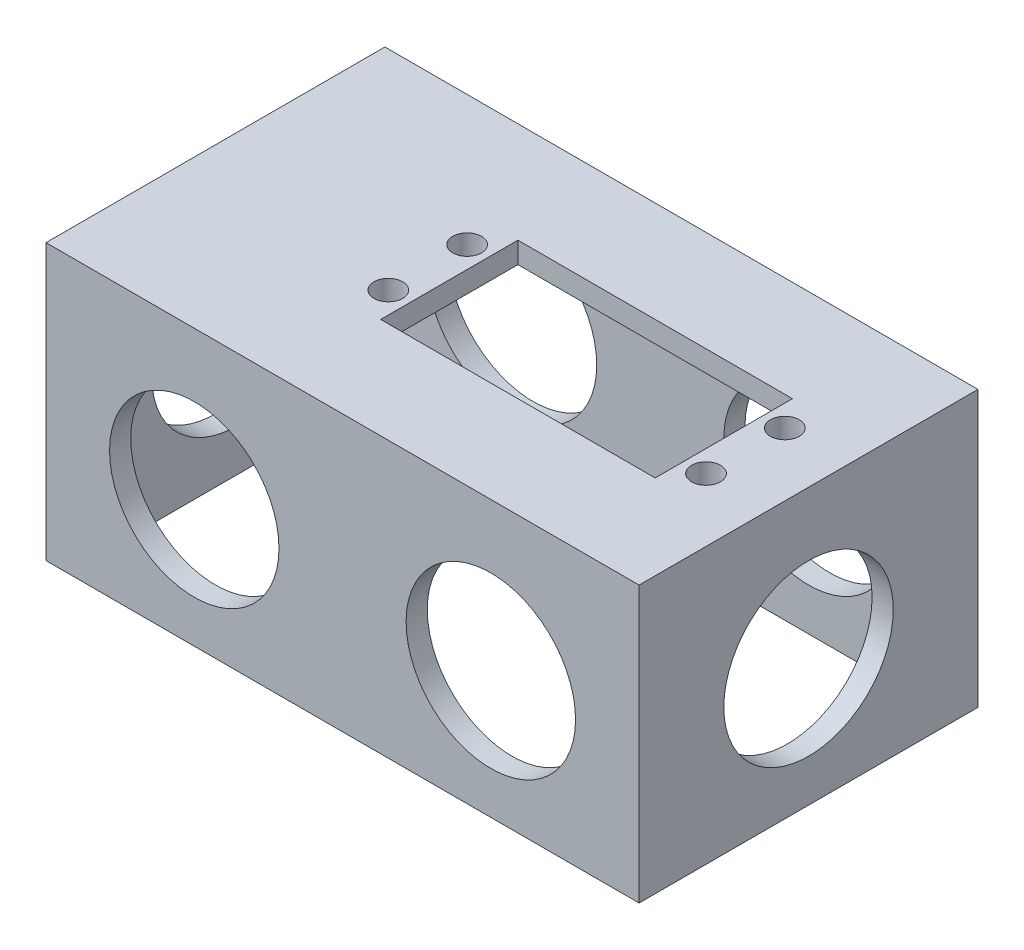
ISO-10303-21;
HEADER;
FILE_DESCRIPTION(('STEP AP214'),'2;1');
FILE_NAME('part.step','',(''),(''),'','','');
FILE_SCHEMA(('AUTOMOTIVE_DESIGN { 1 0 10303 214 1 1 1 1 }'));
ENDSEC;
DATA;
#1=APPLICATION_CONTEXT('core data for automotive mechanical design processes');
#2=APPLICATION_PROTOCOL_DEFINITION('international standard','automotive_design',2000,#1);
#3=PRODUCT_CONTEXT('',#1,'mechanical');
#4=PRODUCT('Part','Part','',(#3));
#5=PRODUCT_RELATED_PRODUCT_CATEGORY('part','',(#4));
#6=PRODUCT_DEFINITION_FORMATION('','',#4);
#7=PRODUCT_DEFINITION_CONTEXT('part definition',#1,'design');
#8=PRODUCT_DEFINITION('design','',#6,#7);
#9=PRODUCT_DEFINITION_SHAPE('','',#8);
#10=(LENGTH_UNIT() NAMED_UNIT(*) SI_UNIT(.MILLI.,.METRE.));
#11=(NAMED_UNIT(*) PLANE_ANGLE_UNIT() SI_UNIT($,.RADIAN.));
#12=(NAMED_UNIT(*) SI_UNIT($,.STERADIAN.) SOLID_ANGLE_UNIT());
#13=UNCERTAINTY_MEASURE_WITH_UNIT(LENGTH_MEASURE(1.E-05),#10,'distance_accuracy_value','');
#14=(GEOMETRIC_REPRESENTATION_CONTEXT(3) GLOBAL_UNCERTAINTY_ASSIGNED_CONTEXT((#13)) GLOBAL_UNIT_ASSIGNED_CONTEXT((#10,
#11,#12)) REPRESENTATION_CONTEXT('',''));
#15=CARTESIAN_POINT('',(0.,0.,0.));
#16=DIRECTION('',(0.,0.,1.));
#17=DIRECTION('',(1.,0.,0.));
#18=AXIS2_PLACEMENT_3D('',#15,#16,#17);
#19=CARTESIAN_POINT('',(0.,38.1,0.));
#20=DIRECTION('',(0.,-1.,0.));
#21=DIRECTION('',(0.,0.,-1.));
#22=AXIS2_PLACEMENT_3D('',#19,#20,#21);
#23=PLANE('',#22);
#24=CARTESIAN_POINT('',(79.4385,38.1,-31.3055));
#25=DIRECTION('',(0.,-1.,0.));
#26=DIRECTION('',(0.,0.,-1.));
#27=AXIS2_PLACEMENT_3D('',#24,#25,#26);
#28=CIRCLE('',#27,2.15900000000001);
#29=CARTESIAN_POINT('',(79.4385,38.1,-33.4645));
#30=VERTEX_POINT('',#29);
#31=EDGE_CURVE('E387',#30,#30,#28,.F.);
#32=ORIENTED_EDGE('',*,*,#31,.T.);
#33=EDGE_LOOP('',(#32));
#34=FACE_BOUND('',#33,.T.);
#35=CARTESIAN_POINT('',(79.4385,38.1,-19.4945));
#36=DIRECTION('',(0.,-1.,0.));
#37=DIRECTION('',(0.,0.,-1.));
#38=AXIS2_PLACEMENT_3D('',#35,#36,#37);
#39=CIRCLE('',#38,2.15900000000001);
#40=CARTESIAN_POINT('',(79.4385,38.1,-21.6535));
#41=VERTEX_POINT('',#40);
#42=EDGE_CURVE('E390',#41,#41,#39,.F.);
#43=ORIENTED_EDGE('',*,*,#42,.T.);
#44=EDGE_LOOP('',(#43));
#45=FACE_BOUND('',#44,.T.);
#46=CARTESIAN_POINT('',(31.8135,38.1,-19.4945));
#47=DIRECTION('',(0.,-1.,0.));
#48=DIRECTION('',(0.,0.,-1.));
#49=AXIS2_PLACEMENT_3D('',#46,#47,#48);
#50=CIRCLE('',#49,2.15899999999999);
#51=CARTESIAN_POINT('',(31.8135,38.1,-21.6535));
#52=VERTEX_POINT('',#51);
#53=EDGE_CURVE('E394',#52,#52,#50,.F.);
#54=ORIENTED_EDGE('',*,*,#53,.T.);
#55=EDGE_LOOP('',(#54));
#56=FACE_BOUND('',#55,.T.);
#57=CARTESIAN_POINT('',(31.8135,38.1,-31.3055));
#58=DIRECTION('',(0.,-1.,0.));
#59=DIRECTION('',(0.,0.,-1.));
#60=AXIS2_PLACEMENT_3D('',#57,#58,#59);
#61=CIRCLE('',#60,2.15899999999999);
#62=CARTESIAN_POINT('',(31.8135,38.1,-33.4645));
#63=VERTEX_POINT('',#62);
#64=EDGE_CURVE('E384',#63,#63,#61,.F.);
#65=ORIENTED_EDGE('',*,*,#64,.T.);
#66=EDGE_LOOP('',(#65));
#67=FACE_BOUND('',#66,.T.);
#68=DIRECTION('',(0.,0.,1.));
#69=VECTOR('',#68,1.);
#70=CARTESIAN_POINT('',(3.175,38.1,-3.175));
#71=LINE('',#70,#69);
#72=CARTESIAN_POINT('',(3.175,38.1,-47.625));
#73=VERTEX_POINT('',#72);
#74=CARTESIAN_POINT('',(3.175,38.1,-3.175));
#75=VERTEX_POINT('',#74);
#76=EDGE_CURVE('E199',#73,#75,#71,.T.);
#77=ORIENTED_EDGE('',*,*,#76,.F.);
#78=DIRECTION('',(-1.,0.,0.));
#79=VECTOR('',#78,1.);
#80=CARTESIAN_POINT('',(3.175,38.1,-47.625));
#81=LINE('',#80,#79);
#82=CARTESIAN_POINT('',(85.725,38.1,-47.625));
#83=VERTEX_POINT('',#82);
#84=EDGE_CURVE('E209',#83,#73,#81,.T.);
#85=ORIENTED_EDGE('',*,*,#84,.F.);
#86=DIRECTION('',(0.,0.,-1.));
#87=VECTOR('',#86,1.);
#88=CARTESIAN_POINT('',(85.725,38.1,-3.175));
#89=LINE('',#88,#87);
#90=CARTESIAN_POINT('',(85.725,38.1,-3.175));
#91=VERTEX_POINT('',#90);
#92=EDGE_CURVE('E206',#91,#83,#89,.T.);
#93=ORIENTED_EDGE('',*,*,#92,.F.);
#94=DIRECTION('',(1.,0.,0.));
#95=VECTOR('',#94,1.);
#96=CARTESIAN_POINT('',(3.175,38.1,-3.175));
#97=LINE('',#96,#95);
#98=EDGE_CURVE('E202',#75,#91,#97,.T.);
#99=ORIENTED_EDGE('',*,*,#98,.F.);
#100=EDGE_LOOP('',(#77,#85,#93,#99));
#101=FACE_BOUND('',#100,.T.);
#102=DIRECTION('',(1.,0.,0.));
#103=VECTOR('',#102,1.);
#104=CARTESIAN_POINT('',(76.2,38.1,-15.113));
#105=LINE('',#104,#103);
#106=CARTESIAN_POINT('',(35.052,38.1,-15.113));
#107=VERTEX_POINT('',#106);
#108=CARTESIAN_POINT('',(76.2,38.1,-15.113));
#109=VERTEX_POINT('',#108);
#110=EDGE_CURVE('E140',#107,#109,#105,.T.);
#111=ORIENTED_EDGE('',*,*,#110,.T.);
#112=DIRECTION('',(0.,0.,-1.));
#113=VECTOR('',#112,1.);
#114=CARTESIAN_POINT('',(76.2,38.1,-15.113));
#115=LINE('',#114,#113);
#116=CARTESIAN_POINT('',(76.2,38.1,-35.687));
#117=VERTEX_POINT('',#116);
#118=EDGE_CURVE('E135',#109,#117,#115,.T.);
#119=ORIENTED_EDGE('',*,*,#118,.T.);
#120=DIRECTION('',(-1.,0.,0.));
#121=VECTOR('',#120,1.);
#122=CARTESIAN_POINT('',(76.2,38.1,-35.687));
#123=LINE('',#122,#121);
#124=CARTESIAN_POINT('',(35.052,38.1,-35.687));
#125=VERTEX_POINT('',#124);
#126=EDGE_CURVE('E124',#117,#125,#123,.T.);
#127=ORIENTED_EDGE('',*,*,#126,.T.);
#128=DIRECTION('',(0.,0.,1.));
#129=VECTOR('',#128,1.);
#130=CARTESIAN_POINT('',(35.052,38.1,-15.113));
#131=LINE('',#130,#129);
#132=EDGE_CURVE('E144',#125,#107,#131,.T.);
#133=ORIENTED_EDGE('',*,*,#132,.T.);
#134=EDGE_LOOP('',(#111,#119,#127,#133));
#135=FACE_BOUND('',#134,.T.);
#136=ADVANCED_FACE('F34',(#34,#45,#56,#67,#101,#135),#23,.T.);
#137=CARTESIAN_POINT('',(0.,0.,0.));
#138=DIRECTION('',(0.,-1.,0.));
#139=DIRECTION('',(0.,0.,-1.));
#140=AXIS2_PLACEMENT_3D('',#137,#138,#139);
#141=PLANE('',#140);
#142=DIRECTION('',(0.,0.,1.));
#143=VECTOR('',#142,1.);
#144=CARTESIAN_POINT('',(0.,0.,0.));
#145=LINE('',#144,#143);
#146=CARTESIAN_POINT('',(0.,0.,-50.8));
#147=VERTEX_POINT('',#146);
#148=CARTESIAN_POINT('',(0.,0.,0.));
#149=VERTEX_POINT('',#148);
#150=EDGE_CURVE('E232',#147,#149,#145,.T.);
#151=ORIENTED_EDGE('',*,*,#150,.F.);
#152=DIRECTION('',(-1.,0.,0.));
#153=VECTOR('',#152,1.);
#154=CARTESIAN_POINT('',(0.,0.,-50.8));
#155=LINE('',#154,#153);
#156=CARTESIAN_POINT('',(88.9,0.,-50.8));
#157=VERTEX_POINT('',#156);
#158=EDGE_CURVE('E239',#157,#147,#155,.T.);
#159=ORIENTED_EDGE('',*,*,#158,.F.);
#160=DIRECTION('',(0.,0.,-1.));
#161=VECTOR('',#160,1.);
#162=CARTESIAN_POINT('',(88.9,0.,0.));
#163=LINE('',#162,#161);
#164=CARTESIAN_POINT('',(88.9,0.,0.));
#165=VERTEX_POINT('',#164);
#166=EDGE_CURVE('E237',#165,#157,#163,.T.);
#167=ORIENTED_EDGE('',*,*,#166,.F.);
#168=DIRECTION('',(1.,0.,0.));
#169=VECTOR('',#168,1.);
#170=CARTESIAN_POINT('',(0.,0.,0.));
#171=LINE('',#170,#169);
#172=EDGE_CURVE('E235',#149,#165,#171,.T.);
#173=ORIENTED_EDGE('',*,*,#172,.F.);
#174=EDGE_LOOP('',(#151,#159,#167,#173));
#175=FACE_BOUND('',#174,.T.);
#176=DIRECTION('',(-1.,0.,0.));
#177=VECTOR('',#176,1.);
#178=CARTESIAN_POINT('',(3.175,0.,-47.625));
#179=LINE('',#178,#177);
#180=CARTESIAN_POINT('',(85.725,0.,-47.625));
#181=VERTEX_POINT('',#180);
#182=CARTESIAN_POINT('',(3.175,0.,-47.625));
#183=VERTEX_POINT('',#182);
#184=EDGE_CURVE('E203',#181,#183,#179,.T.);
#185=ORIENTED_EDGE('',*,*,#184,.T.);
#186=DIRECTION('',(0.,0.,1.));
#187=VECTOR('',#186,1.);
#188=CARTESIAN_POINT('',(3.175,0.,-3.175));
#189=LINE('',#188,#187);
#190=CARTESIAN_POINT('',(3.175,0.,-3.175));
#191=VERTEX_POINT('',#190);
#192=EDGE_CURVE('E198',#183,#191,#189,.T.);
#193=ORIENTED_EDGE('',*,*,#192,.T.);
#194=DIRECTION('',(1.,0.,0.));
#195=VECTOR('',#194,1.);
#196=CARTESIAN_POINT('',(3.175,0.,-3.175));
#197=LINE('',#196,#195);
#198=CARTESIAN_POINT('',(85.725,0.,-3.175));
#199=VERTEX_POINT('',#198);
#200=EDGE_CURVE('E215',#191,#199,#197,.T.);
#201=ORIENTED_EDGE('',*,*,#200,.T.);
#202=DIRECTION('',(0.,0.,-1.));
#203=VECTOR('',#202,1.);
#204=CARTESIAN_POINT('',(85.725,0.,-3.175));
#205=LINE('',#204,#203);
#206=EDGE_CURVE('E218',#199,#181,#205,.T.);
#207=ORIENTED_EDGE('',*,*,#206,.T.);
#208=EDGE_LOOP('',(#185,#193,#201,#207));
#209=FACE_BOUND('',#208,.T.);
#210=ADVANCED_FACE('F268',(#175,#209),#141,.T.);
#211=CARTESIAN_POINT('',(0.,38.1,0.));
#212=DIRECTION('',(1.,0.,0.));
#213=DIRECTION('',(0.,0.,-1.));
#214=AXIS2_PLACEMENT_3D('',#211,#212,#213);
#215=PLANE('',#214);
#216=CARTESIAN_POINT('',(0.,19.05,-25.4));
#217=DIRECTION('',(1.,0.,0.));
#218=DIRECTION('',(0.,0.,-1.));
#219=AXIS2_PLACEMENT_3D('',#216,#217,#218);
#220=CIRCLE('',#219,12.7);
#221=CARTESIAN_POINT('',(0.,19.05,-38.1));
#222=VERTEX_POINT('',#221);
#223=EDGE_CURVE('E191',#222,#222,#220,.F.);
#224=ORIENTED_EDGE('',*,*,#223,.F.);
#225=EDGE_LOOP('',(#224));
#226=FACE_BOUND('',#225,.T.);
#227=ORIENTED_EDGE('',*,*,#150,.T.);
#228=DIRECTION('',(0.,-1.,0.));
#229=VECTOR('',#228,1.);
#230=CARTESIAN_POINT('',(0.,38.1,0.));
#231=LINE('',#230,#229);
#232=CARTESIAN_POINT('',(0.,41.275,0.));
#233=VERTEX_POINT('',#232);
#234=EDGE_CURVE('E11',#233,#149,#231,.T.);
#235=ORIENTED_EDGE('',*,*,#234,.F.);
#236=DIRECTION('',(0.,0.,1.));
#237=VECTOR('',#236,1.);
#238=CARTESIAN_POINT('',(0.,41.275,-50.8));
#239=LINE('',#238,#237);
#240=CARTESIAN_POINT('',(0.,41.275,-50.8));
#241=VERTEX_POINT('',#240);
#242=EDGE_CURVE('E182',#241,#233,#239,.T.);
#243=ORIENTED_EDGE('',*,*,#242,.F.);
#244=DIRECTION('',(0.,-1.,0.));
#245=VECTOR('',#244,1.);
#246=CARTESIAN_POINT('',(0.,38.1,-50.8));
#247=LINE('',#246,#245);
#248=EDGE_CURVE('E241',#241,#147,#247,.T.);
#249=ORIENTED_EDGE('',*,*,#248,.T.);
#250=EDGE_LOOP('',(#227,#235,#243,#249));
#251=FACE_BOUND('',#250,.T.);
#252=ADVANCED_FACE('F36',(#226,#251),#215,.F.);
#253=CARTESIAN_POINT('',(0.,38.1,0.));
#254=DIRECTION('',(0.,0.,-1.));
#255=DIRECTION('',(-1.,0.,0.));
#256=AXIS2_PLACEMENT_3D('',#253,#254,#255);
#257=PLANE('',#256);
#258=CARTESIAN_POINT('',(66.675,19.05,0.));
#259=DIRECTION('',(0.,0.,-1.));
#260=DIRECTION('',(-1.,0.,0.));
#261=AXIS2_PLACEMENT_3D('',#258,#259,#260);
#262=CIRCLE('',#261,12.7);
#263=CARTESIAN_POINT('',(53.975,19.05,0.));
#264=VERTEX_POINT('',#263);
#265=EDGE_CURVE('E161',#264,#264,#262,.F.);
#266=ORIENTED_EDGE('',*,*,#265,.F.);
#267=EDGE_LOOP('',(#266));
#268=FACE_BOUND('',#267,.T.);
#269=CARTESIAN_POINT('',(22.225,19.05,0.));
#270=DIRECTION('',(0.,0.,-1.));
#271=DIRECTION('',(-1.,0.,0.));
#272=AXIS2_PLACEMENT_3D('',#269,#270,#271);
#273=CIRCLE('',#272,12.7);
#274=CARTESIAN_POINT('',(9.525,19.05,0.));
#275=VERTEX_POINT('',#274);
#276=EDGE_CURVE('E162',#275,#275,#273,.F.);
#277=ORIENTED_EDGE('',*,*,#276,.F.);
#278=EDGE_LOOP('',(#277));
#279=FACE_BOUND('',#278,.T.);
#280=ORIENTED_EDGE('',*,*,#172,.T.);
#281=DIRECTION('',(0.,-1.,0.));
#282=VECTOR('',#281,1.);
#283=CARTESIAN_POINT('',(88.9,38.1,0.));
#284=LINE('',#283,#282);
#285=CARTESIAN_POINT('',(88.9,41.275,0.));
#286=VERTEX_POINT('',#285);
#287=EDGE_CURVE('E43',#286,#165,#284,.T.);
#288=ORIENTED_EDGE('',*,*,#287,.F.);
#289=DIRECTION('',(1.,0.,0.));
#290=VECTOR('',#289,1.);
#291=CARTESIAN_POINT('',(88.9,41.275,0.));
#292=LINE('',#291,#290);
#293=EDGE_CURVE('E185',#233,#286,#292,.T.);
#294=ORIENTED_EDGE('',*,*,#293,.F.);
#295=ORIENTED_EDGE('',*,*,#234,.T.);
#296=EDGE_LOOP('',(#280,#288,#294,#295));
#297=FACE_BOUND('',#296,.T.);
#298=ADVANCED_FACE('F319',(#268,#279,#297),#257,.F.);
#299=CARTESIAN_POINT('',(88.9,38.1,0.));
#300=DIRECTION('',(-1.,0.,0.));
#301=DIRECTION('',(0.,0.,1.));
#302=AXIS2_PLACEMENT_3D('',#299,#300,#301);
#303=PLANE('',#302);
#304=CARTESIAN_POINT('',(88.9,19.05,-25.4));
#305=DIRECTION('',(1.,0.,0.));
#306=DIRECTION('',(0.,0.,-1.));
#307=AXIS2_PLACEMENT_3D('',#304,#305,#306);
#308=CIRCLE('',#307,12.7);
#309=CARTESIAN_POINT('',(88.9,19.05,-38.1));
#310=VERTEX_POINT('',#309);
#311=EDGE_CURVE('E188',#310,#310,#308,.T.);
#312=ORIENTED_EDGE('',*,*,#311,.F.);
#313=EDGE_LOOP('',(#312));
#314=FACE_BOUND('',#313,.T.);
#315=ORIENTED_EDGE('',*,*,#166,.T.);
#316=DIRECTION('',(0.,-1.,0.));
#317=VECTOR('',#316,1.);
#318=CARTESIAN_POINT('',(88.9,38.1,-50.8));
#319=LINE('',#318,#317);
#320=CARTESIAN_POINT('',(88.9,41.275,-50.8));
#321=VERTEX_POINT('',#320);
#322=EDGE_CURVE('E244',#321,#157,#319,.T.);
#323=ORIENTED_EDGE('',*,*,#322,.F.);
#324=DIRECTION('',(0.,0.,-1.));
#325=VECTOR('',#324,1.);
#326=CARTESIAN_POINT('',(88.9,41.275,-50.8));
#327=LINE('',#326,#325);
#328=EDGE_CURVE('E176',#286,#321,#327,.T.);
#329=ORIENTED_EDGE('',*,*,#328,.F.);
#330=ORIENTED_EDGE('',*,*,#287,.T.);
#331=EDGE_LOOP('',(#315,#323,#329,#330));
#332=FACE_BOUND('',#331,.T.);
#333=ADVANCED_FACE('F287',(#314,#332),#303,.F.);
#334=CARTESIAN_POINT('',(0.,38.1,-50.8));
#335=DIRECTION('',(0.,0.,1.));
#336=DIRECTION('',(1.,0.,0.));
#337=AXIS2_PLACEMENT_3D('',#334,#335,#336);
#338=PLANE('',#337);
#339=CARTESIAN_POINT('',(66.675,19.05,-50.8));
#340=DIRECTION('',(0.,0.,-1.));
#341=DIRECTION('',(-1.,0.,0.));
#342=AXIS2_PLACEMENT_3D('',#339,#340,#341);
#343=CIRCLE('',#342,12.7);
#344=CARTESIAN_POINT('',(53.975,19.05,-50.8));
#345=VERTEX_POINT('',#344);
#346=EDGE_CURVE('E158',#345,#345,#343,.T.);
#347=ORIENTED_EDGE('',*,*,#346,.F.);
#348=EDGE_LOOP('',(#347));
#349=FACE_BOUND('',#348,.T.);
#350=CARTESIAN_POINT('',(22.225,19.05,-50.8));
#351=DIRECTION('',(0.,0.,-1.));
#352=DIRECTION('',(-1.,0.,0.));
#353=AXIS2_PLACEMENT_3D('',#350,#351,#352);
#354=CIRCLE('',#353,12.7);
#355=CARTESIAN_POINT('',(9.525,19.05,-50.8));
#356=VERTEX_POINT('',#355);
#357=EDGE_CURVE('E131',#356,#356,#354,.T.);
#358=ORIENTED_EDGE('',*,*,#357,.F.);
#359=EDGE_LOOP('',(#358));
#360=FACE_BOUND('',#359,.T.);
#361=ORIENTED_EDGE('',*,*,#158,.T.);
#362=ORIENTED_EDGE('',*,*,#248,.F.);
#363=DIRECTION('',(-1.,0.,0.));
#364=VECTOR('',#363,1.);
#365=CARTESIAN_POINT('',(88.9,41.275,-50.8));
#366=LINE('',#365,#364);
#367=EDGE_CURVE('E179',#321,#241,#366,.T.);
#368=ORIENTED_EDGE('',*,*,#367,.F.);
#369=ORIENTED_EDGE('',*,*,#322,.T.);
#370=EDGE_LOOP('',(#361,#362,#368,#369));
#371=FACE_BOUND('',#370,.T.);
#372=ADVANCED_FACE('F278',(#349,#360,#371),#338,.F.);
#373=CARTESIAN_POINT('',(3.175,38.1,-3.175));
#374=DIRECTION('',(1.,0.,0.));
#375=DIRECTION('',(0.,0.,-1.));
#376=AXIS2_PLACEMENT_3D('',#373,#374,#375);
#377=PLANE('',#376);
#378=CARTESIAN_POINT('',(3.175,19.05,-25.4));
#379=DIRECTION('',(1.,0.,0.));
#380=DIRECTION('',(0.,0.,-1.));
#381=AXIS2_PLACEMENT_3D('',#378,#379,#380);
#382=CIRCLE('',#381,12.7);
#383=CARTESIAN_POINT('',(3.175,19.05,-38.1));
#384=VERTEX_POINT('',#383);
#385=EDGE_CURVE('E195',#384,#384,#382,.T.);
#386=ORIENTED_EDGE('',*,*,#385,.F.);
#387=EDGE_LOOP('',(#386));
#388=FACE_BOUND('',#387,.T.);
#389=ORIENTED_EDGE('',*,*,#192,.F.);
#390=DIRECTION('',(0.,-1.,0.));
#391=VECTOR('',#390,1.);
#392=CARTESIAN_POINT('',(3.175,38.1,-47.625));
#393=LINE('',#392,#391);
#394=EDGE_CURVE('E212',#73,#183,#393,.T.);
#395=ORIENTED_EDGE('',*,*,#394,.F.);
#396=ORIENTED_EDGE('',*,*,#76,.T.);
#397=DIRECTION('',(0.,-1.,0.));
#398=VECTOR('',#397,1.);
#399=CARTESIAN_POINT('',(3.175,38.1,-3.175));
#400=LINE('',#399,#398);
#401=EDGE_CURVE('E229',#75,#191,#400,.T.);
#402=ORIENTED_EDGE('',*,*,#401,.T.);
#403=EDGE_LOOP('',(#389,#395,#396,#402));
#404=FACE_BOUND('',#403,.T.);
#405=ADVANCED_FACE('F276',(#388,#404),#377,.T.);
#406=CARTESIAN_POINT('',(3.175,38.1,-3.175));
#407=DIRECTION('',(0.,0.,-1.));
#408=DIRECTION('',(-1.,0.,0.));
#409=AXIS2_PLACEMENT_3D('',#406,#407,#408);
#410=PLANE('',#409);
#411=CARTESIAN_POINT('',(66.675,19.05,-3.17499999999999));
#412=DIRECTION('',(0.,0.,-1.));
#413=DIRECTION('',(-1.,0.,0.));
#414=AXIS2_PLACEMENT_3D('',#411,#412,#413);
#415=CIRCLE('',#414,12.7);
#416=CARTESIAN_POINT('',(53.975,19.05,-3.17499999999999));
#417=VERTEX_POINT('',#416);
#418=EDGE_CURVE('E173',#417,#417,#415,.T.);
#419=ORIENTED_EDGE('',*,*,#418,.F.);
#420=EDGE_LOOP('',(#419));
#421=FACE_BOUND('',#420,.T.);
#422=CARTESIAN_POINT('',(22.225,19.05,-3.17499999999999));
#423=DIRECTION('',(0.,0.,-1.));
#424=DIRECTION('',(-1.,0.,0.));
#425=AXIS2_PLACEMENT_3D('',#422,#423,#424);
#426=CIRCLE('',#425,12.7);
#427=CARTESIAN_POINT('',(9.525,19.05,-3.17499999999999));
#428=VERTEX_POINT('',#427);
#429=EDGE_CURVE('E170',#428,#428,#426,.T.);
#430=ORIENTED_EDGE('',*,*,#429,.F.);
#431=EDGE_LOOP('',(#430));
#432=FACE_BOUND('',#431,.T.);
#433=ORIENTED_EDGE('',*,*,#200,.F.);
#434=ORIENTED_EDGE('',*,*,#401,.F.);
#435=ORIENTED_EDGE('',*,*,#98,.T.);
#436=DIRECTION('',(0.,-1.,0.));
#437=VECTOR('',#436,1.);
#438=CARTESIAN_POINT('',(85.725,38.1,-3.175));
#439=LINE('',#438,#437);
#440=EDGE_CURVE('E227',#91,#199,#439,.T.);
#441=ORIENTED_EDGE('',*,*,#440,.T.);
#442=EDGE_LOOP('',(#433,#434,#435,#441));
#443=FACE_BOUND('',#442,.T.);
#444=ADVANCED_FACE('F274',(#421,#432,#443),#410,.T.);
#445=CARTESIAN_POINT('',(85.725,38.1,-3.175));
#446=DIRECTION('',(-1.,0.,0.));
#447=DIRECTION('',(0.,0.,1.));
#448=AXIS2_PLACEMENT_3D('',#445,#446,#447);
#449=PLANE('',#448);
#450=CARTESIAN_POINT('',(85.725,19.05,-25.4));
#451=DIRECTION('',(-1.,0.,0.));
#452=DIRECTION('',(0.,0.,1.));
#453=AXIS2_PLACEMENT_3D('',#450,#451,#452);
#454=CIRCLE('',#453,12.7);
#455=CARTESIAN_POINT('',(85.725,19.05,-12.7));
#456=VERTEX_POINT('',#455);
#457=EDGE_CURVE('E194',#456,#456,#454,.T.);
#458=ORIENTED_EDGE('',*,*,#457,.F.);
#459=EDGE_LOOP('',(#458));
#460=FACE_BOUND('',#459,.T.);
#461=ORIENTED_EDGE('',*,*,#206,.F.);
#462=ORIENTED_EDGE('',*,*,#440,.F.);
#463=ORIENTED_EDGE('',*,*,#92,.T.);
#464=DIRECTION('',(0.,-1.,0.));
#465=VECTOR('',#464,1.);
#466=CARTESIAN_POINT('',(85.725,38.1,-47.625));
#467=LINE('',#466,#465);
#468=EDGE_CURVE('E225',#83,#181,#467,.T.);
#469=ORIENTED_EDGE('',*,*,#468,.T.);
#470=EDGE_LOOP('',(#461,#462,#463,#469));
#471=FACE_BOUND('',#470,.T.);
#472=ADVANCED_FACE('F260',(#460,#471),#449,.T.);
#473=CARTESIAN_POINT('',(3.175,38.1,-47.625));
#474=DIRECTION('',(0.,0.,1.));
#475=DIRECTION('',(1.,0.,0.));
#476=AXIS2_PLACEMENT_3D('',#473,#474,#475);
#477=PLANE('',#476);
#478=CARTESIAN_POINT('',(66.675,19.05,-47.625));
#479=DIRECTION('',(0.,0.,1.));
#480=DIRECTION('',(1.,0.,0.));
#481=AXIS2_PLACEMENT_3D('',#478,#479,#480);
#482=CIRCLE('',#481,12.7);
#483=CARTESIAN_POINT('',(79.375,19.05,-47.625));
#484=VERTEX_POINT('',#483);
#485=EDGE_CURVE('E38',#484,#484,#482,.T.);
#486=ORIENTED_EDGE('',*,*,#485,.F.);
#487=EDGE_LOOP('',(#486));
#488=FACE_BOUND('',#487,.T.);
#489=CARTESIAN_POINT('',(22.225,19.05,-47.625));
#490=DIRECTION('',(0.,0.,1.));
#491=DIRECTION('',(1.,0.,0.));
#492=AXIS2_PLACEMENT_3D('',#489,#490,#491);
#493=CIRCLE('',#492,12.7);
#494=CARTESIAN_POINT('',(34.925,19.05,-47.625));
#495=VERTEX_POINT('',#494);
#496=EDGE_CURVE('E165',#495,#495,#493,.T.);
#497=ORIENTED_EDGE('',*,*,#496,.F.);
#498=EDGE_LOOP('',(#497));
#499=FACE_BOUND('',#498,.T.);
#500=ORIENTED_EDGE('',*,*,#184,.F.);
#501=ORIENTED_EDGE('',*,*,#468,.F.);
#502=ORIENTED_EDGE('',*,*,#84,.T.);
#503=ORIENTED_EDGE('',*,*,#394,.T.);
#504=EDGE_LOOP('',(#500,#501,#502,#503));
#505=FACE_BOUND('',#504,.T.);
#506=ADVANCED_FACE('F256',(#488,#499,#505),#477,.T.);
#507=CARTESIAN_POINT('',(-35.9210244842766,19.05,-25.4));
#508=DIRECTION('',(1.,0.,0.));
#509=DIRECTION('',(0.,0.,-1.));
#510=AXIS2_PLACEMENT_3D('',#507,#508,#509);
#511=CYLINDRICAL_SURFACE('',#510,12.7);
#512=ORIENTED_EDGE('',*,*,#457,.T.);
#513=EDGE_LOOP('',(#512));
#514=FACE_BOUND('',#513,.T.);
#515=ORIENTED_EDGE('',*,*,#311,.T.);
#516=EDGE_LOOP('',(#515));
#517=FACE_BOUND('',#516,.T.);
#518=ADVANCED_FACE('F259',(#514,#517),#511,.F.);
#519=ORIENTED_EDGE('',*,*,#385,.T.);
#520=EDGE_LOOP('',(#519));
#521=FACE_BOUND('',#520,.T.);
#522=ORIENTED_EDGE('',*,*,#223,.T.);
#523=EDGE_LOOP('',(#522));
#524=FACE_BOUND('',#523,.T.);
#525=ADVANCED_FACE('F306',(#521,#524),#511,.F.);
#526=CARTESIAN_POINT('',(0.,41.275,0.));
#527=DIRECTION('',(0.,-1.,0.));
#528=DIRECTION('',(0.,0.,-1.));
#529=AXIS2_PLACEMENT_3D('',#526,#527,#528);
#530=PLANE('',#529);
#531=CARTESIAN_POINT('',(79.4385,41.275,-31.3055));
#532=DIRECTION('',(0.,1.,0.));
#533=DIRECTION('',(0.,0.,1.));
#534=AXIS2_PLACEMENT_3D('',#531,#532,#533);
#535=CIRCLE('',#534,2.15900000000001);
#536=CARTESIAN_POINT('',(79.4385,41.275,-29.1465));
#537=VERTEX_POINT('',#536);
#538=EDGE_CURVE('E366',#537,#537,#535,.T.);
#539=ORIENTED_EDGE('',*,*,#538,.F.);
#540=EDGE_LOOP('',(#539));
#541=FACE_BOUND('',#540,.T.);
#542=CARTESIAN_POINT('',(79.4385,41.275,-19.4945));
#543=DIRECTION('',(0.,1.,0.));
#544=DIRECTION('',(0.,0.,1.));
#545=AXIS2_PLACEMENT_3D('',#542,#543,#544);
#546=CIRCLE('',#545,2.15900000000001);
#547=CARTESIAN_POINT('',(79.4385,41.275,-17.3355));
#548=VERTEX_POINT('',#547);
#549=EDGE_CURVE('E370',#548,#548,#546,.T.);
#550=ORIENTED_EDGE('',*,*,#549,.F.);
#551=EDGE_LOOP('',(#550));
#552=FACE_BOUND('',#551,.T.);
#553=CARTESIAN_POINT('',(31.8135,41.275,-19.4945));
#554=DIRECTION('',(0.,1.,0.));
#555=DIRECTION('',(0.,0.,1.));
#556=AXIS2_PLACEMENT_3D('',#553,#554,#555);
#557=CIRCLE('',#556,2.15899999999999);
#558=CARTESIAN_POINT('',(31.8135,41.275,-17.3355));
#559=VERTEX_POINT('',#558);
#560=EDGE_CURVE('E374',#559,#559,#557,.T.);
#561=ORIENTED_EDGE('',*,*,#560,.F.);
#562=EDGE_LOOP('',(#561));
#563=FACE_BOUND('',#562,.T.);
#564=CARTESIAN_POINT('',(31.8135,41.275,-31.3055));
#565=DIRECTION('',(0.,1.,0.));
#566=DIRECTION('',(0.,0.,1.));
#567=AXIS2_PLACEMENT_3D('',#564,#565,#566);
#568=CIRCLE('',#567,2.15899999999999);
#569=CARTESIAN_POINT('',(31.8135,41.275,-29.1465));
#570=VERTEX_POINT('',#569);
#571=EDGE_CURVE('E378',#570,#570,#568,.T.);
#572=ORIENTED_EDGE('',*,*,#571,.F.);
#573=EDGE_LOOP('',(#572));
#574=FACE_BOUND('',#573,.T.);
#575=DIRECTION('',(-1.,0.,0.));
#576=VECTOR('',#575,1.);
#577=CARTESIAN_POINT('',(76.2,41.275,-35.687));
#578=LINE('',#577,#576);
#579=CARTESIAN_POINT('',(76.2,41.275,-35.687));
#580=VERTEX_POINT('',#579);
#581=CARTESIAN_POINT('',(35.052,41.275,-35.687));
#582=VERTEX_POINT('',#581);
#583=EDGE_CURVE('E142',#580,#582,#578,.T.);
#584=ORIENTED_EDGE('',*,*,#583,.F.);
#585=DIRECTION('',(0.,0.,-1.));
#586=VECTOR('',#585,1.);
#587=CARTESIAN_POINT('',(76.2,41.275,-15.113));
#588=LINE('',#587,#586);
#589=CARTESIAN_POINT('',(76.2,41.275,-15.113));
#590=VERTEX_POINT('',#589);
#591=EDGE_CURVE('E59',#590,#580,#588,.T.);
#592=ORIENTED_EDGE('',*,*,#591,.F.);
#593=DIRECTION('',(1.,0.,0.));
#594=VECTOR('',#593,1.);
#595=CARTESIAN_POINT('',(76.2,41.275,-15.113));
#596=LINE('',#595,#594);
#597=CARTESIAN_POINT('',(35.052,41.275,-15.113));
#598=VERTEX_POINT('',#597);
#599=EDGE_CURVE('E137',#598,#590,#596,.T.);
#600=ORIENTED_EDGE('',*,*,#599,.F.);
#601=DIRECTION('',(0.,0.,1.));
#602=VECTOR('',#601,1.);
#603=CARTESIAN_POINT('',(35.052,41.275,-15.113));
#604=LINE('',#603,#602);
#605=EDGE_CURVE('E149',#582,#598,#604,.T.);
#606=ORIENTED_EDGE('',*,*,#605,.F.);
#607=EDGE_LOOP('',(#584,#592,#600,#606));
#608=FACE_BOUND('',#607,.T.);
#609=ORIENTED_EDGE('',*,*,#328,.T.);
#610=ORIENTED_EDGE('',*,*,#367,.T.);
#611=ORIENTED_EDGE('',*,*,#242,.T.);
#612=ORIENTED_EDGE('',*,*,#293,.T.);
#613=EDGE_LOOP('',(#609,#610,#611,#612));
#614=FACE_BOUND('',#613,.T.);
#615=ADVANCED_FACE('F303',(#541,#552,#563,#574,#608,#614),#530,.F.);
#616=CARTESIAN_POINT('',(22.225,19.05,35.9210244842766));
#617=DIRECTION('',(0.,0.,-1.));
#618=DIRECTION('',(-1.,0.,0.));
#619=AXIS2_PLACEMENT_3D('',#616,#617,#618);
#620=CYLINDRICAL_SURFACE('',#619,12.7);
#621=ORIENTED_EDGE('',*,*,#496,.T.);
#622=EDGE_LOOP('',(#621));
#623=FACE_BOUND('',#622,.T.);
#624=ORIENTED_EDGE('',*,*,#357,.T.);
#625=EDGE_LOOP('',(#624));
#626=FACE_BOUND('',#625,.T.);
#627=ADVANCED_FACE('F253',(#623,#626),#620,.F.);
#628=CARTESIAN_POINT('',(66.675,19.05,35.9210244842766));
#629=DIRECTION('',(0.,0.,-1.));
#630=DIRECTION('',(-1.,0.,0.));
#631=AXIS2_PLACEMENT_3D('',#628,#629,#630);
#632=CYLINDRICAL_SURFACE('',#631,12.7);
#633=ORIENTED_EDGE('',*,*,#485,.T.);
#634=EDGE_LOOP('',(#633));
#635=FACE_BOUND('',#634,.T.);
#636=ORIENTED_EDGE('',*,*,#346,.T.);
#637=EDGE_LOOP('',(#636));
#638=FACE_BOUND('',#637,.T.);
#639=ADVANCED_FACE('F345',(#635,#638),#632,.F.);
#640=ORIENTED_EDGE('',*,*,#429,.T.);
#641=EDGE_LOOP('',(#640));
#642=FACE_BOUND('',#641,.T.);
#643=ORIENTED_EDGE('',*,*,#276,.T.);
#644=EDGE_LOOP('',(#643));
#645=FACE_BOUND('',#644,.T.);
#646=ADVANCED_FACE('F342',(#642,#645),#620,.F.);
#647=ORIENTED_EDGE('',*,*,#418,.T.);
#648=EDGE_LOOP('',(#647));
#649=FACE_BOUND('',#648,.T.);
#650=ORIENTED_EDGE('',*,*,#265,.T.);
#651=EDGE_LOOP('',(#650));
#652=FACE_BOUND('',#651,.T.);
#653=ADVANCED_FACE('F344',(#649,#652),#632,.F.);
#654=CARTESIAN_POINT('',(76.2,-0.001000000000001,-15.113));
#655=DIRECTION('',(1.,0.,0.));
#656=DIRECTION('',(0.,0.,-1.));
#657=AXIS2_PLACEMENT_3D('',#654,#655,#656);
#658=PLANE('',#657);
#659=DIRECTION('',(0.,1.,0.));
#660=VECTOR('',#659,1.);
#661=CARTESIAN_POINT('',(76.2,-0.001000000000001,-15.113));
#662=LINE('',#661,#660);
#663=EDGE_CURVE('E132',#109,#590,#662,.T.);
#664=ORIENTED_EDGE('',*,*,#663,.T.);
#665=ORIENTED_EDGE('',*,*,#591,.T.);
#666=DIRECTION('',(0.,1.,0.));
#667=VECTOR('',#666,1.);
#668=CARTESIAN_POINT('',(76.2,-0.001000000000001,-35.687));
#669=LINE('',#668,#667);
#670=EDGE_CURVE('E126',#117,#580,#669,.T.);
#671=ORIENTED_EDGE('',*,*,#670,.F.);
#672=ORIENTED_EDGE('',*,*,#118,.F.);
#673=EDGE_LOOP('',(#664,#665,#671,#672));
#674=FACE_BOUND('',#673,.T.);
#675=ADVANCED_FACE('F134',(#674),#658,.F.);
#676=CARTESIAN_POINT('',(76.2,-0.001000000000001,-15.113));
#677=DIRECTION('',(0.,0.,1.));
#678=DIRECTION('',(1.,0.,0.));
#679=AXIS2_PLACEMENT_3D('',#676,#677,#678);
#680=PLANE('',#679);
#681=DIRECTION('',(0.,1.,0.));
#682=VECTOR('',#681,1.);
#683=CARTESIAN_POINT('',(35.052,-0.001000000000001,-15.113));
#684=LINE('',#683,#682);
#685=EDGE_CURVE('E155',#107,#598,#684,.T.);
#686=ORIENTED_EDGE('',*,*,#685,.T.);
#687=ORIENTED_EDGE('',*,*,#599,.T.);
#688=ORIENTED_EDGE('',*,*,#663,.F.);
#689=ORIENTED_EDGE('',*,*,#110,.F.);
#690=EDGE_LOOP('',(#686,#687,#688,#689));
#691=FACE_BOUND('',#690,.T.);
#692=ADVANCED_FACE('F423',(#691),#680,.F.);
#693=CARTESIAN_POINT('',(35.052,-0.001000000000001,-15.113));
#694=DIRECTION('',(-1.,0.,0.));
#695=DIRECTION('',(0.,0.,1.));
#696=AXIS2_PLACEMENT_3D('',#693,#694,#695);
#697=PLANE('',#696);
#698=DIRECTION('',(0.,1.,0.));
#699=VECTOR('',#698,1.);
#700=CARTESIAN_POINT('',(35.052,-0.001000000000001,-35.687));
#701=LINE('',#700,#699);
#702=EDGE_CURVE('E51',#125,#582,#701,.T.);
#703=ORIENTED_EDGE('',*,*,#702,.T.);
#704=ORIENTED_EDGE('',*,*,#605,.T.);
#705=ORIENTED_EDGE('',*,*,#685,.F.);
#706=ORIENTED_EDGE('',*,*,#132,.F.);
#707=EDGE_LOOP('',(#703,#704,#705,#706));
#708=FACE_BOUND('',#707,.T.);
#709=ADVANCED_FACE('F383',(#708),#697,.F.);
#710=CARTESIAN_POINT('',(76.2,-0.001000000000001,-35.687));
#711=DIRECTION('',(0.,0.,-1.));
#712=DIRECTION('',(-1.,0.,0.));
#713=AXIS2_PLACEMENT_3D('',#710,#711,#712);
#714=PLANE('',#713);
#715=ORIENTED_EDGE('',*,*,#670,.T.);
#716=ORIENTED_EDGE('',*,*,#583,.T.);
#717=ORIENTED_EDGE('',*,*,#702,.F.);
#718=ORIENTED_EDGE('',*,*,#126,.F.);
#719=EDGE_LOOP('',(#715,#716,#717,#718));
#720=FACE_BOUND('',#719,.T.);
#721=ADVANCED_FACE('F125',(#720),#714,.F.);
#722=CARTESIAN_POINT('',(31.8135,-0.001000000000001,-31.3055));
#723=DIRECTION('',(0.,1.,0.));
#724=DIRECTION('',(0.,0.,1.));
#725=AXIS2_PLACEMENT_3D('',#722,#723,#724);
#726=CYLINDRICAL_SURFACE('',#725,2.15899999999999);
#727=ORIENTED_EDGE('',*,*,#64,.F.);
#728=EDGE_LOOP('',(#727));
#729=FACE_BOUND('',#728,.T.);
#730=ORIENTED_EDGE('',*,*,#571,.T.);
#731=EDGE_LOOP('',(#730));
#732=FACE_BOUND('',#731,.T.);
#733=ADVANCED_FACE('F402',(#729,#732),#726,.F.);
#734=CARTESIAN_POINT('',(31.8135,-0.001000000000001,-19.4945));
#735=DIRECTION('',(0.,1.,0.));
#736=DIRECTION('',(0.,0.,1.));
#737=AXIS2_PLACEMENT_3D('',#734,#735,#736);
#738=CYLINDRICAL_SURFACE('',#737,2.15899999999999);
#739=ORIENTED_EDGE('',*,*,#53,.F.);
#740=EDGE_LOOP('',(#739));
#741=FACE_BOUND('',#740,.T.);
#742=ORIENTED_EDGE('',*,*,#560,.T.);
#743=EDGE_LOOP('',(#742));
#744=FACE_BOUND('',#743,.T.);
#745=ADVANCED_FACE('F405',(#741,#744),#738,.F.);
#746=CARTESIAN_POINT('',(79.4385,-0.001000000000001,-19.4945));
#747=DIRECTION('',(0.,1.,0.));
#748=DIRECTION('',(0.,0.,1.));
#749=AXIS2_PLACEMENT_3D('',#746,#747,#748);
#750=CYLINDRICAL_SURFACE('',#749,2.15900000000001);
#751=ORIENTED_EDGE('',*,*,#42,.F.);
#752=EDGE_LOOP('',(#751));
#753=FACE_BOUND('',#752,.T.);
#754=ORIENTED_EDGE('',*,*,#549,.T.);
#755=EDGE_LOOP('',(#754));
#756=FACE_BOUND('',#755,.T.);
#757=ADVANCED_FACE('F411',(#753,#756),#750,.F.);
#758=CARTESIAN_POINT('',(79.4385,-0.001000000000001,-31.3055));
#759=DIRECTION('',(0.,1.,0.));
#760=DIRECTION('',(0.,0.,1.));
#761=AXIS2_PLACEMENT_3D('',#758,#759,#760);
#762=CYLINDRICAL_SURFACE('',#761,2.15900000000001);
#763=ORIENTED_EDGE('',*,*,#31,.F.);
#764=EDGE_LOOP('',(#763));
#765=FACE_BOUND('',#764,.T.);
#766=ORIENTED_EDGE('',*,*,#538,.T.);
#767=EDGE_LOOP('',(#766));
#768=FACE_BOUND('',#767,.T.);
#769=ADVANCED_FACE('F418',(#765,#768),#762,.F.);
#770=CLOSED_SHELL('',(#136,#210,#252,#298,#333,#372,#405,#444,#472,#506,#518,#525,#615,#627,
#639,#646,#653,#675,#692,#709,#721,#733,#745,#757,#769));
#771=MANIFOLD_SOLID_BREP('B2',#770);
#772=ADVANCED_BREP_SHAPE_REPRESENTATION('',(#18,#771),#14);
#773=SHAPE_DEFINITION_REPRESENTATION(#9,#772);
ENDSEC;
END-ISO-10303-21;
